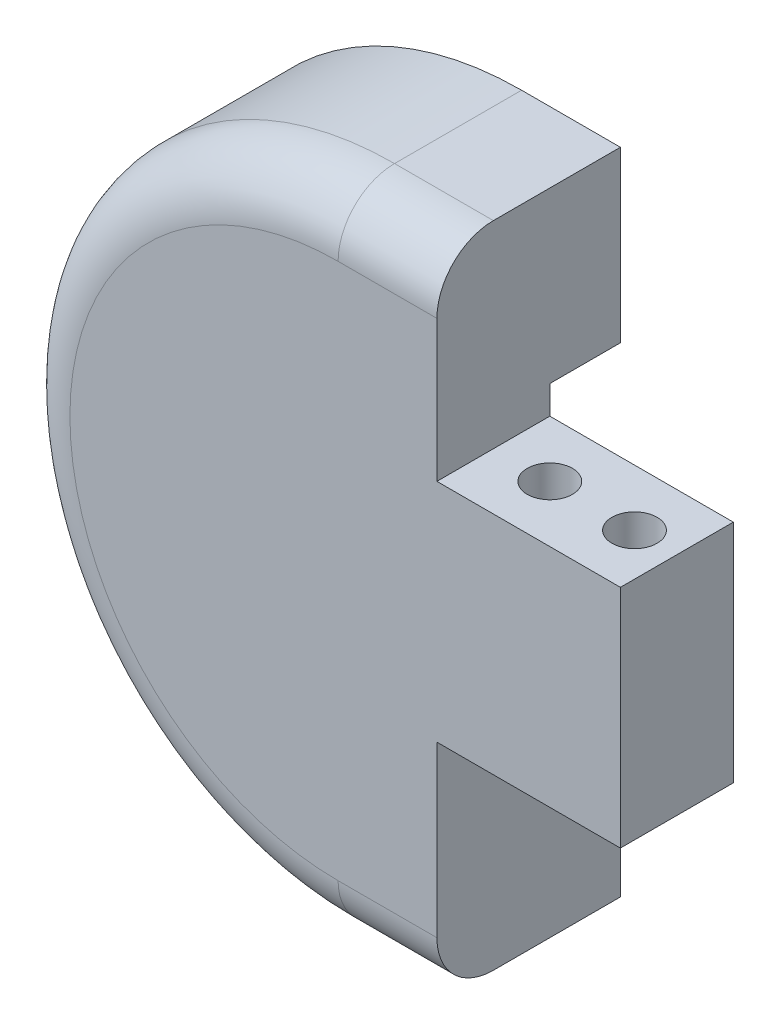
ISO-10303-21;
HEADER;
FILE_DESCRIPTION(('STEP AP214'),'2;1');
FILE_NAME('part.step','',(''),(''),'','','');
FILE_SCHEMA(('AUTOMOTIVE_DESIGN { 1 0 10303 214 1 1 1 1 }'));
ENDSEC;
DATA;
#1=APPLICATION_CONTEXT('core data for automotive mechanical design processes');
#2=APPLICATION_PROTOCOL_DEFINITION('international standard','automotive_design',2000,#1);
#3=PRODUCT_CONTEXT('',#1,'mechanical');
#4=PRODUCT('Part','Part','',(#3));
#5=PRODUCT_RELATED_PRODUCT_CATEGORY('part','',(#4));
#6=PRODUCT_DEFINITION_FORMATION('','',#4);
#7=PRODUCT_DEFINITION_CONTEXT('part definition',#1,'design');
#8=PRODUCT_DEFINITION('design','',#6,#7);
#9=PRODUCT_DEFINITION_SHAPE('','',#8);
#10=(LENGTH_UNIT() NAMED_UNIT(*) SI_UNIT(.MILLI.,.METRE.));
#11=(NAMED_UNIT(*) PLANE_ANGLE_UNIT() SI_UNIT($,.RADIAN.));
#12=(NAMED_UNIT(*) SI_UNIT($,.STERADIAN.) SOLID_ANGLE_UNIT());
#13=UNCERTAINTY_MEASURE_WITH_UNIT(LENGTH_MEASURE(1.E-05),#10,'distance_accuracy_value','');
#14=(GEOMETRIC_REPRESENTATION_CONTEXT(3) GLOBAL_UNCERTAINTY_ASSIGNED_CONTEXT((#13)) GLOBAL_UNIT_ASSIGNED_CONTEXT((#10,
#11,#12)) REPRESENTATION_CONTEXT('',''));
#15=CARTESIAN_POINT('',(0.,0.,0.));
#16=DIRECTION('',(0.,0.,1.));
#17=DIRECTION('',(1.,0.,0.));
#18=AXIS2_PLACEMENT_3D('',#15,#16,#17);
#19=CARTESIAN_POINT('',(0.,0.,2.5));
#20=DIRECTION('',(0.,0.,1.));
#21=DIRECTION('',(1.,0.,0.));
#22=AXIS2_PLACEMENT_3D('',#19,#20,#21);
#23=PLANE('',#22);
#24=DIRECTION('',(1.,0.,0.));
#25=VECTOR('',#24,1.);
#26=CARTESIAN_POINT('',(-3.99999999999979,-4.99999999999957,2.5));
#27=LINE('',#26,#25);
#28=CARTESIAN_POINT('',(-3.99999999999979,-4.99999999999957,2.5));
#29=VERTEX_POINT('',#28);
#30=CARTESIAN_POINT('',(3.5,-4.99999999999954,2.5));
#31=VERTEX_POINT('',#30);
#32=EDGE_CURVE('E396',#29,#31,#27,.T.);
#33=ORIENTED_EDGE('',*,*,#32,.F.);
#34=DIRECTION('',(0.,-1.,0.));
#35=VECTOR('',#34,1.);
#36=CARTESIAN_POINT('',(-3.99999999999982,-3.99999999999956,2.5));
#37=LINE('',#36,#35);
#38=CARTESIAN_POINT('',(-3.99999999999982,-3.99999999999956,2.5));
#39=VERTEX_POINT('',#38);
#40=EDGE_CURVE('E166',#39,#29,#37,.T.);
#41=ORIENTED_EDGE('',*,*,#40,.F.);
#42=DIRECTION('',(0.447213595499985,-0.894427190999903,0.));
#43=VECTOR('',#42,1.);
#44=CARTESIAN_POINT('',(-5.49999999999991,-0.999999999999595,2.5));
#45=LINE('',#44,#43);
#46=CARTESIAN_POINT('',(-5.49999999999991,-0.999999999999595,2.5));
#47=VERTEX_POINT('',#46);
#48=EDGE_CURVE('E160',#47,#39,#45,.T.);
#49=ORIENTED_EDGE('',*,*,#48,.F.);
#50=DIRECTION('',(0.,-1.,0.));
#51=VECTOR('',#50,1.);
#52=CARTESIAN_POINT('',(-5.49999999999993,0.500000000000406,2.5));
#53=LINE('',#52,#51);
#54=CARTESIAN_POINT('',(-5.5,2.0000000000004,2.5));
#55=VERTEX_POINT('',#54);
#56=EDGE_CURVE('E164',#55,#47,#53,.T.);
#57=ORIENTED_EDGE('',*,*,#56,.F.);
#58=DIRECTION('',(-0.44721359549993,-0.89442719099993,0.));
#59=VECTOR('',#58,1.);
#60=CARTESIAN_POINT('',(-5.5,2.0000000000004,2.5));
#61=LINE('',#60,#59);
#62=CARTESIAN_POINT('',(-4.00000000000008,5.00000000000047,2.5));
#63=VERTEX_POINT('',#62);
#64=EDGE_CURVE('E320',#63,#55,#61,.T.);
#65=ORIENTED_EDGE('',*,*,#64,.F.);
#66=DIRECTION('',(-1.11022302462496E-13,-1.,0.));
#67=VECTOR('',#66,1.);
#68=CARTESIAN_POINT('',(-4.00000000000008,5.00000000000047,2.5));
#69=LINE('',#68,#67);
#70=CARTESIAN_POINT('',(-3.99999999999997,6.00000000000065,2.5));
#71=VERTEX_POINT('',#70);
#72=EDGE_CURVE('E318',#71,#63,#69,.T.);
#73=ORIENTED_EDGE('',*,*,#72,.F.);
#74=DIRECTION('',(-1.,0.,0.));
#75=VECTOR('',#74,1.);
#76=CARTESIAN_POINT('',(0.,6.00000000000066,2.5));
#77=LINE('',#76,#75);
#78=CARTESIAN_POINT('',(3.5,6.00000000000067,2.5));
#79=VERTEX_POINT('',#78);
#80=EDGE_CURVE('E314',#79,#71,#77,.T.);
#81=ORIENTED_EDGE('',*,*,#80,.F.);
#82=DIRECTION('',(0.,1.,0.));
#83=VECTOR('',#82,1.);
#84=CARTESIAN_POINT('',(3.5,12.,2.5));
#85=LINE('',#84,#83);
#86=CARTESIAN_POINT('',(3.5,5.,2.5));
#87=VERTEX_POINT('',#86);
#88=EDGE_CURVE('E11',#87,#79,#85,.T.);
#89=ORIENTED_EDGE('',*,*,#88,.F.);
#90=DIRECTION('',(-1.,0.,0.));
#91=VECTOR('',#90,1.);
#92=CARTESIAN_POINT('',(4.25000000000448,5.00000000000051,2.5));
#93=LINE('',#92,#91);
#94=CARTESIAN_POINT('',(10.,5.00000000000051,2.5));
#95=VERTEX_POINT('',#94);
#96=EDGE_CURVE('E311',#95,#87,#93,.T.);
#97=ORIENTED_EDGE('',*,*,#96,.F.);
#98=DIRECTION('',(0.,1.,0.));
#99=VECTOR('',#98,1.);
#100=CARTESIAN_POINT('',(10.,-4.00000000000375,2.5));
#101=LINE('',#100,#99);
#102=CARTESIAN_POINT('',(10.,-3.,2.5));
#103=VERTEX_POINT('',#102);
#104=EDGE_CURVE('E315',#103,#95,#101,.T.);
#105=ORIENTED_EDGE('',*,*,#104,.F.);
#106=DIRECTION('',(1.,0.,0.));
#107=VECTOR('',#106,1.);
#108=CARTESIAN_POINT('',(10.,-3.,2.5));
#109=LINE('',#108,#107);
#110=CARTESIAN_POINT('',(3.5,-3.,2.5));
#111=VERTEX_POINT('',#110);
#112=EDGE_CURVE('E189',#111,#103,#109,.T.);
#113=ORIENTED_EDGE('',*,*,#112,.F.);
#114=DIRECTION('',(0.,1.,0.));
#115=VECTOR('',#114,1.);
#116=CARTESIAN_POINT('',(3.5,-3.,2.5));
#117=LINE('',#116,#115);
#118=EDGE_CURVE('E192',#31,#111,#117,.T.);
#119=ORIENTED_EDGE('',*,*,#118,.F.);
#120=EDGE_LOOP('',(#33,#41,#49,#57,#65,#73,#81,#89,#97,#105,#113,#119));
#121=FACE_BOUND('',#120,.T.);
#122=CARTESIAN_POINT('',(0.,0.,2.5));
#123=DIRECTION('',(0.,0.,1.));
#124=DIRECTION('',(1.,0.,0.));
#125=AXIS2_PLACEMENT_3D('',#122,#123,#124);
#126=CIRCLE('',#125,2.75);
#127=CARTESIAN_POINT('',(2.75,0.,2.5));
#128=VERTEX_POINT('',#127);
#129=EDGE_CURVE('E391',#128,#128,#126,.T.);
#130=ORIENTED_EDGE('',*,*,#129,.T.);
#131=EDGE_LOOP('',(#130));
#132=FACE_BOUND('',#131,.T.);
#133=ADVANCED_FACE('F33',(#121,#132),#23,.F.);
#134=CARTESIAN_POINT('',(3.5,-3.,6.5));
#135=DIRECTION('',(-1.,0.,0.));
#136=DIRECTION('',(0.,0.,1.));
#137=AXIS2_PLACEMENT_3D('',#134,#135,#136);
#138=PLANE('',#137);
#139=DIRECTION('',(0.,0.,-1.));
#140=VECTOR('',#139,1.);
#141=CARTESIAN_POINT('',(3.5,-4.99999999999955,6.5));
#142=LINE('',#141,#140);
#143=CARTESIAN_POINT('',(3.5,-4.99999999999955,0.));
#144=VERTEX_POINT('',#143);
#145=EDGE_CURVE('E182',#31,#144,#142,.T.);
#146=ORIENTED_EDGE('',*,*,#145,.F.);
#147=ORIENTED_EDGE('',*,*,#118,.T.);
#148=DIRECTION('',(0.,0.,-1.));
#149=VECTOR('',#148,1.);
#150=CARTESIAN_POINT('',(3.5,-3.,6.5));
#151=LINE('',#150,#149);
#152=CARTESIAN_POINT('',(3.5,-3.,6.5));
#153=VERTEX_POINT('',#152);
#154=EDGE_CURVE('E243',#153,#111,#151,.T.);
#155=ORIENTED_EDGE('',*,*,#154,.F.);
#156=DIRECTION('',(0.,1.,0.));
#157=VECTOR('',#156,1.);
#158=CARTESIAN_POINT('',(3.5,-3.,6.5));
#159=LINE('',#158,#157);
#160=CARTESIAN_POINT('',(3.5,-9.,6.5));
#161=VERTEX_POINT('',#160);
#162=EDGE_CURVE('E205',#161,#153,#159,.T.);
#163=ORIENTED_EDGE('',*,*,#162,.F.);
#164=CARTESIAN_POINT('',(3.5,-9.,4.5));
#165=DIRECTION('',(-1.,0.,0.));
#166=DIRECTION('',(0.,0.,1.));
#167=AXIS2_PLACEMENT_3D('',#164,#165,#166);
#168=CIRCLE('',#167,2.);
#169=CARTESIAN_POINT('',(3.5,-11.,4.5));
#170=VERTEX_POINT('',#169);
#171=EDGE_CURVE('E266',#161,#170,#168,.F.);
#172=ORIENTED_EDGE('',*,*,#171,.T.);
#173=DIRECTION('',(0.,0.,-1.));
#174=VECTOR('',#173,1.);
#175=CARTESIAN_POINT('',(3.5,-11.,6.5));
#176=LINE('',#175,#174);
#177=CARTESIAN_POINT('',(3.5,-11.,0.));
#178=VERTEX_POINT('',#177);
#179=EDGE_CURVE('E246',#170,#178,#176,.T.);
#180=ORIENTED_EDGE('',*,*,#179,.T.);
#181=DIRECTION('',(0.,1.,0.));
#182=VECTOR('',#181,1.);
#183=CARTESIAN_POINT('',(3.5,-3.,0.));
#184=LINE('',#183,#182);
#185=EDGE_CURVE('E223',#178,#144,#184,.T.);
#186=ORIENTED_EDGE('',*,*,#185,.T.);
#187=EDGE_LOOP('',(#146,#147,#155,#163,#172,#180,#186));
#188=FACE_BOUND('',#187,.T.);
#189=ADVANCED_FACE('F365',(#188),#138,.F.);
#190=CARTESIAN_POINT('',(3.5,12.,6.5));
#191=DIRECTION('',(-1.,0.,0.));
#192=DIRECTION('',(0.,0.,1.));
#193=AXIS2_PLACEMENT_3D('',#190,#191,#192);
#194=PLANE('',#193);
#195=DIRECTION('',(0.,0.,1.));
#196=VECTOR('',#195,1.);
#197=CARTESIAN_POINT('',(3.5,6.00000000000067,6.5));
#198=LINE('',#197,#196);
#199=CARTESIAN_POINT('',(3.5,6.00000000000067,0.));
#200=VERTEX_POINT('',#199);
#201=EDGE_CURVE('E179',#200,#79,#198,.T.);
#202=ORIENTED_EDGE('',*,*,#201,.F.);
#203=DIRECTION('',(0.,1.,0.));
#204=VECTOR('',#203,1.);
#205=CARTESIAN_POINT('',(3.5,12.,0.));
#206=LINE('',#205,#204);
#207=CARTESIAN_POINT('',(3.5,12.,0.));
#208=VERTEX_POINT('',#207);
#209=EDGE_CURVE('E226',#200,#208,#206,.T.);
#210=ORIENTED_EDGE('',*,*,#209,.T.);
#211=DIRECTION('',(0.,0.,-1.));
#212=VECTOR('',#211,1.);
#213=CARTESIAN_POINT('',(3.5,12.,6.5));
#214=LINE('',#213,#212);
#215=CARTESIAN_POINT('',(3.5,12.,4.5));
#216=VERTEX_POINT('',#215);
#217=EDGE_CURVE('E231',#216,#208,#214,.T.);
#218=ORIENTED_EDGE('',*,*,#217,.F.);
#219=CARTESIAN_POINT('',(3.5,10.,4.5));
#220=DIRECTION('',(-1.,0.,0.));
#221=DIRECTION('',(0.,0.,1.));
#222=AXIS2_PLACEMENT_3D('',#219,#220,#221);
#223=CIRCLE('',#222,2.);
#224=CARTESIAN_POINT('',(3.5,10.,6.5));
#225=VERTEX_POINT('',#224);
#226=EDGE_CURVE('E264',#216,#225,#223,.F.);
#227=ORIENTED_EDGE('',*,*,#226,.T.);
#228=DIRECTION('',(0.,1.,0.));
#229=VECTOR('',#228,1.);
#230=CARTESIAN_POINT('',(3.5,12.,6.5));
#231=LINE('',#230,#229);
#232=CARTESIAN_POINT('',(3.5,5.,6.5));
#233=VERTEX_POINT('',#232);
#234=EDGE_CURVE('E214',#233,#225,#231,.T.);
#235=ORIENTED_EDGE('',*,*,#234,.F.);
#236=DIRECTION('',(0.,0.,-1.));
#237=VECTOR('',#236,1.);
#238=CARTESIAN_POINT('',(3.5,5.,6.5));
#239=LINE('',#238,#237);
#240=EDGE_CURVE('E234',#233,#87,#239,.T.);
#241=ORIENTED_EDGE('',*,*,#240,.T.);
#242=ORIENTED_EDGE('',*,*,#88,.T.);
#243=EDGE_LOOP('',(#202,#210,#218,#227,#235,#241,#242));
#244=FACE_BOUND('',#243,.T.);
#245=ADVANCED_FACE('F285',(#244),#194,.F.);
#246=CARTESIAN_POINT('',(0.,0.5,0.));
#247=DIRECTION('',(0.,0.,1.));
#248=DIRECTION('',(1.,0.,0.));
#249=AXIS2_PLACEMENT_3D('',#246,#247,#248);
#250=PLANE('',#249);
#251=DIRECTION('',(1.,0.,0.));
#252=VECTOR('',#251,1.);
#253=CARTESIAN_POINT('',(0.,-4.99999999999956,0.));
#254=LINE('',#253,#252);
#255=CARTESIAN_POINT('',(-3.99999999999979,-4.99999999999957,0.));
#256=VERTEX_POINT('',#255);
#257=EDGE_CURVE('E330',#256,#144,#254,.T.);
#258=ORIENTED_EDGE('',*,*,#257,.T.);
#259=ORIENTED_EDGE('',*,*,#185,.F.);
#260=DIRECTION('',(1.,0.,0.));
#261=VECTOR('',#260,1.);
#262=CARTESIAN_POINT('',(0.,-11.,0.));
#263=LINE('',#262,#261);
#264=CARTESIAN_POINT('',(0.,-11.,0.));
#265=VERTEX_POINT('',#264);
#266=EDGE_CURVE('E220',#265,#178,#263,.T.);
#267=ORIENTED_EDGE('',*,*,#266,.F.);
#268=CARTESIAN_POINT('',(0.,0.5,0.));
#269=DIRECTION('',(0.,0.,1.));
#270=DIRECTION('',(1.,0.,0.));
#271=AXIS2_PLACEMENT_3D('',#268,#269,#270);
#272=CIRCLE('',#271,11.5);
#273=CARTESIAN_POINT('',(0.,12.,0.));
#274=VERTEX_POINT('',#273);
#275=EDGE_CURVE('E204',#274,#265,#272,.T.);
#276=ORIENTED_EDGE('',*,*,#275,.F.);
#277=DIRECTION('',(-1.,0.,0.));
#278=VECTOR('',#277,1.);
#279=CARTESIAN_POINT('',(0.,12.,0.));
#280=LINE('',#279,#278);
#281=EDGE_CURVE('E208',#208,#274,#280,.T.);
#282=ORIENTED_EDGE('',*,*,#281,.F.);
#283=ORIENTED_EDGE('',*,*,#209,.F.);
#284=DIRECTION('',(1.,0.,0.));
#285=VECTOR('',#284,1.);
#286=CARTESIAN_POINT('',(0.,6.00000000000066,0.));
#287=LINE('',#286,#285);
#288=CARTESIAN_POINT('',(-3.99999999999997,6.00000000000065,0.));
#289=VERTEX_POINT('',#288);
#290=EDGE_CURVE('E41',#289,#200,#287,.T.);
#291=ORIENTED_EDGE('',*,*,#290,.F.);
#292=DIRECTION('',(-1.11022302462496E-13,-1.,0.));
#293=VECTOR('',#292,1.);
#294=CARTESIAN_POINT('',(-4.00000000000008,5.00000000000047,0.));
#295=LINE('',#294,#293);
#296=CARTESIAN_POINT('',(-4.00000000000008,5.00000000000047,0.));
#297=VERTEX_POINT('',#296);
#298=EDGE_CURVE('E332',#289,#297,#295,.T.);
#299=ORIENTED_EDGE('',*,*,#298,.T.);
#300=DIRECTION('',(-0.44721359549993,-0.89442719099993,0.));
#301=VECTOR('',#300,1.);
#302=CARTESIAN_POINT('',(-5.5,2.0000000000004,0.));
#303=LINE('',#302,#301);
#304=CARTESIAN_POINT('',(-5.5,2.0000000000004,0.));
#305=VERTEX_POINT('',#304);
#306=EDGE_CURVE('E334',#297,#305,#303,.T.);
#307=ORIENTED_EDGE('',*,*,#306,.T.);
#308=DIRECTION('',(0.,-1.,0.));
#309=VECTOR('',#308,1.);
#310=CARTESIAN_POINT('',(-5.5,2.0000000000004,0.));
#311=LINE('',#310,#309);
#312=CARTESIAN_POINT('',(-5.49999999999986,-0.999999999999595,0.));
#313=VERTEX_POINT('',#312);
#314=EDGE_CURVE('E173',#305,#313,#311,.T.);
#315=ORIENTED_EDGE('',*,*,#314,.T.);
#316=DIRECTION('',(0.447213595499985,-0.894427190999903,0.));
#317=VECTOR('',#316,1.);
#318=CARTESIAN_POINT('',(-5.49999999999991,-0.999999999999595,0.));
#319=LINE('',#318,#317);
#320=CARTESIAN_POINT('',(-3.99999999999982,-3.99999999999956,0.));
#321=VERTEX_POINT('',#320);
#322=EDGE_CURVE('E177',#313,#321,#319,.T.);
#323=ORIENTED_EDGE('',*,*,#322,.T.);
#324=DIRECTION('',(0.,-1.,0.));
#325=VECTOR('',#324,1.);
#326=CARTESIAN_POINT('',(-3.99999999999982,-3.99999999999956,0.));
#327=LINE('',#326,#325);
#328=EDGE_CURVE('E326',#321,#256,#327,.T.);
#329=ORIENTED_EDGE('',*,*,#328,.T.);
#330=EDGE_LOOP('',(#258,#259,#267,#276,#282,#283,#291,#299,#307,#315,#323,#329));
#331=FACE_BOUND('',#330,.T.);
#332=ADVANCED_FACE('F290',(#331),#250,.F.);
#333=CARTESIAN_POINT('',(0.,0.5,6.5));
#334=DIRECTION('',(0.,0.,-1.));
#335=DIRECTION('',(-1.,0.,0.));
#336=AXIS2_PLACEMENT_3D('',#333,#334,#335);
#337=CYLINDRICAL_SURFACE('',#336,11.5);
#338=DIRECTION('',(0.,0.,-1.));
#339=VECTOR('',#338,1.);
#340=CARTESIAN_POINT('',(0.,-11.,6.5));
#341=LINE('',#340,#339);
#342=CARTESIAN_POINT('',(0.,-11.,4.5));
#343=VERTEX_POINT('',#342);
#344=EDGE_CURVE('E248',#343,#265,#341,.T.);
#345=ORIENTED_EDGE('',*,*,#344,.F.);
#346=CARTESIAN_POINT('',(0.,0.5,4.5));
#347=DIRECTION('',(0.,0.,1.));
#348=DIRECTION('',(1.,0.,0.));
#349=AXIS2_PLACEMENT_3D('',#346,#347,#348);
#350=CIRCLE('',#349,11.5);
#351=CARTESIAN_POINT('',(0.,12.,4.5));
#352=VERTEX_POINT('',#351);
#353=EDGE_CURVE('E269',#343,#352,#350,.F.);
#354=ORIENTED_EDGE('',*,*,#353,.T.);
#355=DIRECTION('',(0.,0.,-1.));
#356=VECTOR('',#355,1.);
#357=CARTESIAN_POINT('',(0.,12.,6.5));
#358=LINE('',#357,#356);
#359=EDGE_CURVE('E217',#352,#274,#358,.T.);
#360=ORIENTED_EDGE('',*,*,#359,.T.);
#361=ORIENTED_EDGE('',*,*,#275,.T.);
#362=EDGE_LOOP('',(#345,#354,#360,#361));
#363=FACE_BOUND('',#362,.T.);
#364=ADVANCED_FACE('F432',(#363),#337,.T.);
#365=CARTESIAN_POINT('',(0.,-11.,6.5));
#366=DIRECTION('',(0.,1.,0.));
#367=DIRECTION('',(0.,0.,1.));
#368=AXIS2_PLACEMENT_3D('',#365,#366,#367);
#369=PLANE('',#368);
#370=ORIENTED_EDGE('',*,*,#179,.F.);
#371=DIRECTION('',(1.,0.,0.));
#372=VECTOR('',#371,1.);
#373=CARTESIAN_POINT('',(0.,-11.,4.5));
#374=LINE('',#373,#372);
#375=EDGE_CURVE('E56',#170,#343,#374,.F.);
#376=ORIENTED_EDGE('',*,*,#375,.T.);
#377=ORIENTED_EDGE('',*,*,#344,.T.);
#378=ORIENTED_EDGE('',*,*,#266,.T.);
#379=EDGE_LOOP('',(#370,#376,#377,#378));
#380=FACE_BOUND('',#379,.T.);
#381=ADVANCED_FACE('F443',(#380),#369,.F.);
#382=CARTESIAN_POINT('',(10.,-3.,6.5));
#383=DIRECTION('',(0.,1.,0.));
#384=DIRECTION('',(0.,0.,1.));
#385=AXIS2_PLACEMENT_3D('',#382,#383,#384);
#386=PLANE('',#385);
#387=CARTESIAN_POINT('',(5.5,-3.,4.5));
#388=DIRECTION('',(0.,1.,0.));
#389=DIRECTION('',(0.,0.,1.));
#390=AXIS2_PLACEMENT_3D('',#387,#388,#389);
#391=CIRCLE('',#390,0.8);
#392=CARTESIAN_POINT('',(5.5,-3.,5.3));
#393=VERTEX_POINT('',#392);
#394=EDGE_CURVE('E196',#393,#393,#391,.T.);
#395=ORIENTED_EDGE('',*,*,#394,.T.);
#396=EDGE_LOOP('',(#395));
#397=FACE_BOUND('',#396,.T.);
#398=CARTESIAN_POINT('',(8.5,-3.,4.5));
#399=DIRECTION('',(0.,1.,0.));
#400=DIRECTION('',(0.,0.,1.));
#401=AXIS2_PLACEMENT_3D('',#398,#399,#400);
#402=CIRCLE('',#401,0.799999999999999);
#403=CARTESIAN_POINT('',(8.5,-3.,5.3));
#404=VERTEX_POINT('',#403);
#405=EDGE_CURVE('E201',#404,#404,#402,.T.);
#406=ORIENTED_EDGE('',*,*,#405,.T.);
#407=EDGE_LOOP('',(#406));
#408=FACE_BOUND('',#407,.T.);
#409=ORIENTED_EDGE('',*,*,#154,.T.);
#410=ORIENTED_EDGE('',*,*,#112,.T.);
#411=DIRECTION('',(0.,0.,-1.));
#412=VECTOR('',#411,1.);
#413=CARTESIAN_POINT('',(10.,-3.,6.5));
#414=LINE('',#413,#412);
#415=CARTESIAN_POINT('',(10.,-3.,6.5));
#416=VERTEX_POINT('',#415);
#417=EDGE_CURVE('E240',#416,#103,#414,.T.);
#418=ORIENTED_EDGE('',*,*,#417,.F.);
#419=DIRECTION('',(1.,0.,0.));
#420=VECTOR('',#419,1.);
#421=CARTESIAN_POINT('',(10.,-3.,6.5));
#422=LINE('',#421,#420);
#423=EDGE_CURVE('E207',#153,#416,#422,.T.);
#424=ORIENTED_EDGE('',*,*,#423,.F.);
#425=EDGE_LOOP('',(#409,#410,#418,#424));
#426=FACE_BOUND('',#425,.T.);
#427=ADVANCED_FACE('F402',(#397,#408,#426),#386,.F.);
#428=CARTESIAN_POINT('',(10.,5.,6.5));
#429=DIRECTION('',(-1.,0.,0.));
#430=DIRECTION('',(0.,0.,1.));
#431=AXIS2_PLACEMENT_3D('',#428,#429,#430);
#432=PLANE('',#431);
#433=ORIENTED_EDGE('',*,*,#417,.T.);
#434=ORIENTED_EDGE('',*,*,#104,.T.);
#435=DIRECTION('',(0.,0.,-1.));
#436=VECTOR('',#435,1.);
#437=CARTESIAN_POINT('',(10.,5.,6.5));
#438=LINE('',#437,#436);
#439=CARTESIAN_POINT('',(10.,5.,6.5));
#440=VERTEX_POINT('',#439);
#441=EDGE_CURVE('E237',#440,#95,#438,.T.);
#442=ORIENTED_EDGE('',*,*,#441,.F.);
#443=DIRECTION('',(0.,1.,0.));
#444=VECTOR('',#443,1.);
#445=CARTESIAN_POINT('',(10.,5.,6.5));
#446=LINE('',#445,#444);
#447=EDGE_CURVE('E210',#416,#440,#446,.T.);
#448=ORIENTED_EDGE('',*,*,#447,.F.);
#449=EDGE_LOOP('',(#433,#434,#442,#448));
#450=FACE_BOUND('',#449,.T.);
#451=ADVANCED_FACE('F398',(#450),#432,.F.);
#452=CARTESIAN_POINT('',(3.5,5.,6.5));
#453=DIRECTION('',(0.,-1.,0.));
#454=DIRECTION('',(0.,0.,-1.));
#455=AXIS2_PLACEMENT_3D('',#452,#453,#454);
#456=PLANE('',#455);
#457=CARTESIAN_POINT('',(5.5,5.,4.5));
#458=DIRECTION('',(0.,-1.,0.));
#459=DIRECTION('',(0.,0.,-1.));
#460=AXIS2_PLACEMENT_3D('',#457,#458,#459);
#461=CIRCLE('',#460,0.8);
#462=CARTESIAN_POINT('',(5.5,5.,3.7));
#463=VERTEX_POINT('',#462);
#464=EDGE_CURVE('E200',#463,#463,#461,.T.);
#465=ORIENTED_EDGE('',*,*,#464,.T.);
#466=EDGE_LOOP('',(#465));
#467=FACE_BOUND('',#466,.T.);
#468=CARTESIAN_POINT('',(8.5,5.,4.5));
#469=DIRECTION('',(0.,-1.,0.));
#470=DIRECTION('',(0.,0.,-1.));
#471=AXIS2_PLACEMENT_3D('',#468,#469,#470);
#472=CIRCLE('',#471,0.799999999999999);
#473=CARTESIAN_POINT('',(8.5,5.,3.7));
#474=VERTEX_POINT('',#473);
#475=EDGE_CURVE('E199',#474,#474,#472,.T.);
#476=ORIENTED_EDGE('',*,*,#475,.T.);
#477=EDGE_LOOP('',(#476));
#478=FACE_BOUND('',#477,.T.);
#479=ORIENTED_EDGE('',*,*,#441,.T.);
#480=ORIENTED_EDGE('',*,*,#96,.T.);
#481=ORIENTED_EDGE('',*,*,#240,.F.);
#482=DIRECTION('',(-1.,0.,0.));
#483=VECTOR('',#482,1.);
#484=CARTESIAN_POINT('',(3.5,5.,6.5));
#485=LINE('',#484,#483);
#486=EDGE_CURVE('E212',#440,#233,#485,.T.);
#487=ORIENTED_EDGE('',*,*,#486,.F.);
#488=EDGE_LOOP('',(#479,#480,#481,#487));
#489=FACE_BOUND('',#488,.T.);
#490=ADVANCED_FACE('F310',(#467,#478,#489),#456,.F.);
#491=CARTESIAN_POINT('',(0.,12.,6.5));
#492=DIRECTION('',(0.,-1.,0.));
#493=DIRECTION('',(0.,0.,-1.));
#494=AXIS2_PLACEMENT_3D('',#491,#492,#493);
#495=PLANE('',#494);
#496=ORIENTED_EDGE('',*,*,#359,.F.);
#497=DIRECTION('',(-1.,0.,0.));
#498=VECTOR('',#497,1.);
#499=CARTESIAN_POINT('',(3.5,12.,4.5));
#500=LINE('',#499,#498);
#501=EDGE_CURVE('E262',#352,#216,#500,.F.);
#502=ORIENTED_EDGE('',*,*,#501,.T.);
#503=ORIENTED_EDGE('',*,*,#217,.T.);
#504=ORIENTED_EDGE('',*,*,#281,.T.);
#505=EDGE_LOOP('',(#496,#502,#503,#504));
#506=FACE_BOUND('',#505,.T.);
#507=ADVANCED_FACE('F295',(#506),#495,.F.);
#508=CARTESIAN_POINT('',(0.,0.5,6.5));
#509=DIRECTION('',(0.,0.,1.));
#510=DIRECTION('',(1.,0.,0.));
#511=AXIS2_PLACEMENT_3D('',#508,#509,#510);
#512=PLANE('',#511);
#513=ORIENTED_EDGE('',*,*,#234,.T.);
#514=DIRECTION('',(-1.,0.,0.));
#515=VECTOR('',#514,1.);
#516=CARTESIAN_POINT('',(0.,10.,6.5));
#517=LINE('',#516,#515);
#518=CARTESIAN_POINT('',(0.,10.,6.5));
#519=VERTEX_POINT('',#518);
#520=EDGE_CURVE('E259',#225,#519,#517,.T.);
#521=ORIENTED_EDGE('',*,*,#520,.T.);
#522=CARTESIAN_POINT('',(0.,0.5,6.5));
#523=DIRECTION('',(0.,0.,1.));
#524=DIRECTION('',(1.,0.,0.));
#525=AXIS2_PLACEMENT_3D('',#522,#523,#524);
#526=CIRCLE('',#525,9.5);
#527=CARTESIAN_POINT('',(0.,-9.,6.5));
#528=VERTEX_POINT('',#527);
#529=EDGE_CURVE('E250',#519,#528,#526,.T.);
#530=ORIENTED_EDGE('',*,*,#529,.T.);
#531=DIRECTION('',(1.,0.,0.));
#532=VECTOR('',#531,1.);
#533=CARTESIAN_POINT('',(3.5,-9.,6.5));
#534=LINE('',#533,#532);
#535=EDGE_CURVE('E257',#528,#161,#534,.T.);
#536=ORIENTED_EDGE('',*,*,#535,.T.);
#537=ORIENTED_EDGE('',*,*,#162,.T.);
#538=ORIENTED_EDGE('',*,*,#423,.T.);
#539=ORIENTED_EDGE('',*,*,#447,.T.);
#540=ORIENTED_EDGE('',*,*,#486,.T.);
#541=EDGE_LOOP('',(#513,#521,#530,#536,#537,#538,#539,#540));
#542=FACE_BOUND('',#541,.T.);
#543=ADVANCED_FACE('F305',(#542),#512,.T.);
#544=CARTESIAN_POINT('',(8.5,-11.,4.5));
#545=DIRECTION('',(0.,1.,0.));
#546=DIRECTION('',(0.,0.,1.));
#547=AXIS2_PLACEMENT_3D('',#544,#545,#546);
#548=CYLINDRICAL_SURFACE('',#547,0.799999999999999);
#549=ORIENTED_EDGE('',*,*,#475,.F.);
#550=EDGE_LOOP('',(#549));
#551=FACE_BOUND('',#550,.T.);
#552=ORIENTED_EDGE('',*,*,#405,.F.);
#553=EDGE_LOOP('',(#552));
#554=FACE_BOUND('',#553,.T.);
#555=ADVANCED_FACE('F423',(#551,#554),#548,.F.);
#556=CARTESIAN_POINT('',(5.5,-11.,4.5));
#557=DIRECTION('',(0.,1.,0.));
#558=DIRECTION('',(0.,0.,1.));
#559=AXIS2_PLACEMENT_3D('',#556,#557,#558);
#560=CYLINDRICAL_SURFACE('',#559,0.8);
#561=ORIENTED_EDGE('',*,*,#464,.F.);
#562=EDGE_LOOP('',(#561));
#563=FACE_BOUND('',#562,.T.);
#564=ORIENTED_EDGE('',*,*,#394,.F.);
#565=EDGE_LOOP('',(#564));
#566=FACE_BOUND('',#565,.T.);
#567=ADVANCED_FACE('F420',(#563,#566),#560,.F.);
#568=CARTESIAN_POINT('',(0.,-9.,4.5));
#569=DIRECTION('',(-1.,0.,0.));
#570=DIRECTION('',(0.,0.,1.));
#571=AXIS2_PLACEMENT_3D('',#568,#569,#570);
#572=CYLINDRICAL_SURFACE('',#571,2.);
#573=ORIENTED_EDGE('',*,*,#171,.F.);
#574=ORIENTED_EDGE('',*,*,#535,.F.);
#575=CARTESIAN_POINT('',(0.,-9.,4.5));
#576=DIRECTION('',(-1.,0.,0.));
#577=DIRECTION('',(0.,0.,1.));
#578=AXIS2_PLACEMENT_3D('',#575,#576,#577);
#579=CIRCLE('',#578,2.);
#580=EDGE_CURVE('E255',#343,#528,#579,.T.);
#581=ORIENTED_EDGE('',*,*,#580,.F.);
#582=ORIENTED_EDGE('',*,*,#375,.F.);
#583=EDGE_LOOP('',(#573,#574,#581,#582));
#584=FACE_BOUND('',#583,.T.);
#585=ADVANCED_FACE('F35',(#584),#572,.T.);
#586=CARTESIAN_POINT('',(0.,0.5,4.5));
#587=DIRECTION('',(0.,0.,1.));
#588=DIRECTION('',(1.,0.,0.));
#589=AXIS2_PLACEMENT_3D('',#586,#587,#588);
#590=TOROIDAL_SURFACE('',#589,9.5,2.);
#591=ORIENTED_EDGE('',*,*,#580,.T.);
#592=ORIENTED_EDGE('',*,*,#529,.F.);
#593=CARTESIAN_POINT('',(0.,10.,4.5));
#594=DIRECTION('',(1.,0.,0.));
#595=DIRECTION('',(0.,0.,-1.));
#596=AXIS2_PLACEMENT_3D('',#593,#594,#595);
#597=CIRCLE('',#596,2.);
#598=EDGE_CURVE('E195',#352,#519,#597,.T.);
#599=ORIENTED_EDGE('',*,*,#598,.F.);
#600=ORIENTED_EDGE('',*,*,#353,.F.);
#601=EDGE_LOOP('',(#591,#592,#599,#600));
#602=FACE_BOUND('',#601,.T.);
#603=ADVANCED_FACE('F415',(#602),#590,.T.);
#604=CARTESIAN_POINT('',(0.,10.,4.5));
#605=DIRECTION('',(1.,0.,0.));
#606=DIRECTION('',(0.,0.,-1.));
#607=AXIS2_PLACEMENT_3D('',#604,#605,#606);
#608=CYLINDRICAL_SURFACE('',#607,2.);
#609=ORIENTED_EDGE('',*,*,#226,.F.);
#610=ORIENTED_EDGE('',*,*,#501,.F.);
#611=ORIENTED_EDGE('',*,*,#598,.T.);
#612=ORIENTED_EDGE('',*,*,#520,.F.);
#613=EDGE_LOOP('',(#609,#610,#611,#612));
#614=FACE_BOUND('',#613,.T.);
#615=ADVANCED_FACE('F301',(#614),#608,.T.);
#616=CARTESIAN_POINT('',(0.,-4.99999999999956,2.5));
#617=DIRECTION('',(0.,1.,0.));
#618=DIRECTION('',(-1.,0.,0.));
#619=AXIS2_PLACEMENT_3D('',#616,#617,#618);
#620=PLANE('',#619);
#621=ORIENTED_EDGE('',*,*,#145,.T.);
#622=ORIENTED_EDGE('',*,*,#257,.F.);
#623=DIRECTION('',(0.,0.,-1.));
#624=VECTOR('',#623,1.);
#625=CARTESIAN_POINT('',(-3.99999999999979,-4.99999999999957,2.5));
#626=LINE('',#625,#624);
#627=EDGE_CURVE('E184',#29,#256,#626,.T.);
#628=ORIENTED_EDGE('',*,*,#627,.F.);
#629=ORIENTED_EDGE('',*,*,#32,.T.);
#630=EDGE_LOOP('',(#621,#622,#628,#629));
#631=FACE_BOUND('',#630,.T.);
#632=ADVANCED_FACE('F408',(#631),#620,.T.);
#633=CARTESIAN_POINT('',(-3.99999999999997,6.00000000000065,2.5));
#634=DIRECTION('',(0.,-1.,0.));
#635=DIRECTION('',(1.,0.,0.));
#636=AXIS2_PLACEMENT_3D('',#633,#634,#635);
#637=PLANE('',#636);
#638=ORIENTED_EDGE('',*,*,#201,.T.);
#639=ORIENTED_EDGE('',*,*,#80,.T.);
#640=DIRECTION('',(0.,0.,-1.));
#641=VECTOR('',#640,1.);
#642=CARTESIAN_POINT('',(-3.99999999999997,6.00000000000065,2.5));
#643=LINE('',#642,#641);
#644=EDGE_CURVE('E279',#71,#289,#643,.T.);
#645=ORIENTED_EDGE('',*,*,#644,.T.);
#646=ORIENTED_EDGE('',*,*,#290,.T.);
#647=EDGE_LOOP('',(#638,#639,#645,#646));
#648=FACE_BOUND('',#647,.T.);
#649=ADVANCED_FACE('F276',(#648),#637,.T.);
#650=CARTESIAN_POINT('',(-5.49999999999991,-0.999999999999595,2.5));
#651=DIRECTION('',(0.894427190999903,0.447213595499985,0.));
#652=DIRECTION('',(-0.447213595499985,0.894427190999903,0.));
#653=AXIS2_PLACEMENT_3D('',#650,#651,#652);
#654=PLANE('',#653);
#655=ORIENTED_EDGE('',*,*,#322,.F.);
#656=DIRECTION('',(0.,0.,-1.));
#657=VECTOR('',#656,1.);
#658=CARTESIAN_POINT('',(-5.49999999999991,-0.999999999999595,2.5));
#659=LINE('',#658,#657);
#660=EDGE_CURVE('E48',#47,#313,#659,.T.);
#661=ORIENTED_EDGE('',*,*,#660,.F.);
#662=ORIENTED_EDGE('',*,*,#48,.T.);
#663=DIRECTION('',(0.,0.,-1.));
#664=VECTOR('',#663,1.);
#665=CARTESIAN_POINT('',(-3.99999999999982,-3.99999999999956,2.5));
#666=LINE('',#665,#664);
#667=EDGE_CURVE('E180',#39,#321,#666,.T.);
#668=ORIENTED_EDGE('',*,*,#667,.T.);
#669=EDGE_LOOP('',(#655,#661,#662,#668));
#670=FACE_BOUND('',#669,.T.);
#671=ADVANCED_FACE('F175',(#670),#654,.T.);
#672=CARTESIAN_POINT('',(-3.99999999999982,-3.99999999999956,2.5));
#673=DIRECTION('',(1.,0.,0.));
#674=DIRECTION('',(0.,1.,0.));
#675=AXIS2_PLACEMENT_3D('',#672,#673,#674);
#676=PLANE('',#675);
#677=ORIENTED_EDGE('',*,*,#328,.F.);
#678=ORIENTED_EDGE('',*,*,#667,.F.);
#679=ORIENTED_EDGE('',*,*,#40,.T.);
#680=ORIENTED_EDGE('',*,*,#627,.T.);
#681=EDGE_LOOP('',(#677,#678,#679,#680));
#682=FACE_BOUND('',#681,.T.);
#683=ADVANCED_FACE('F345',(#682),#676,.T.);
#684=CARTESIAN_POINT('',(-4.00000000000008,5.00000000000047,2.5));
#685=DIRECTION('',(1.,-1.11022302462496E-13,0.));
#686=DIRECTION('',(1.11022302462496E-13,1.,0.));
#687=AXIS2_PLACEMENT_3D('',#684,#685,#686);
#688=PLANE('',#687);
#689=ORIENTED_EDGE('',*,*,#298,.F.);
#690=ORIENTED_EDGE('',*,*,#644,.F.);
#691=ORIENTED_EDGE('',*,*,#72,.T.);
#692=DIRECTION('',(0.,0.,-1.));
#693=VECTOR('',#692,1.);
#694=CARTESIAN_POINT('',(-4.00000000000008,5.00000000000047,2.5));
#695=LINE('',#694,#693);
#696=EDGE_CURVE('E339',#63,#297,#695,.T.);
#697=ORIENTED_EDGE('',*,*,#696,.T.);
#698=EDGE_LOOP('',(#689,#690,#691,#697));
#699=FACE_BOUND('',#698,.T.);
#700=ADVANCED_FACE('F354',(#699),#688,.T.);
#701=CARTESIAN_POINT('',(-5.5,2.0000000000004,2.5));
#702=DIRECTION('',(0.89442719099993,-0.44721359549993,0.));
#703=DIRECTION('',(0.44721359549993,0.89442719099993,0.));
#704=AXIS2_PLACEMENT_3D('',#701,#702,#703);
#705=PLANE('',#704);
#706=ORIENTED_EDGE('',*,*,#306,.F.);
#707=ORIENTED_EDGE('',*,*,#696,.F.);
#708=ORIENTED_EDGE('',*,*,#64,.T.);
#709=DIRECTION('',(0.,0.,-1.));
#710=VECTOR('',#709,1.);
#711=CARTESIAN_POINT('',(-5.5,2.0000000000004,2.5));
#712=LINE('',#711,#710);
#713=EDGE_CURVE('E172',#55,#305,#712,.T.);
#714=ORIENTED_EDGE('',*,*,#713,.T.);
#715=EDGE_LOOP('',(#706,#707,#708,#714));
#716=FACE_BOUND('',#715,.T.);
#717=ADVANCED_FACE('F352',(#716),#705,.T.);
#718=CARTESIAN_POINT('',(-5.5,2.0000000000004,2.5));
#719=DIRECTION('',(1.,0.,0.));
#720=DIRECTION('',(0.,1.,0.));
#721=AXIS2_PLACEMENT_3D('',#718,#719,#720);
#722=PLANE('',#721);
#723=ORIENTED_EDGE('',*,*,#314,.F.);
#724=ORIENTED_EDGE('',*,*,#713,.F.);
#725=ORIENTED_EDGE('',*,*,#56,.T.);
#726=ORIENTED_EDGE('',*,*,#660,.T.);
#727=EDGE_LOOP('',(#723,#724,#725,#726));
#728=FACE_BOUND('',#727,.T.);
#729=ADVANCED_FACE('F171',(#728),#722,.T.);
#730=CARTESIAN_POINT('',(0.,0.,4.));
#731=DIRECTION('',(0.,0.,-1.));
#732=DIRECTION('',(-1.,0.,0.));
#733=AXIS2_PLACEMENT_3D('',#730,#731,#732);
#734=CYLINDRICAL_SURFACE('',#733,2.75);
#735=CARTESIAN_POINT('',(0.,0.,4.));
#736=DIRECTION('',(0.,0.,1.));
#737=DIRECTION('',(1.,0.,0.));
#738=AXIS2_PLACEMENT_3D('',#735,#736,#737);
#739=CIRCLE('',#738,2.75);
#740=CARTESIAN_POINT('',(2.75,0.,4.));
#741=VERTEX_POINT('',#740);
#742=EDGE_CURVE('E327',#741,#741,#739,.T.);
#743=ORIENTED_EDGE('',*,*,#742,.T.);
#744=EDGE_LOOP('',(#743));
#745=FACE_BOUND('',#744,.T.);
#746=ORIENTED_EDGE('',*,*,#129,.F.);
#747=EDGE_LOOP('',(#746));
#748=FACE_BOUND('',#747,.T.);
#749=ADVANCED_FACE('F374',(#745,#748),#734,.F.);
#750=CARTESIAN_POINT('',(0.,0.,4.));
#751=DIRECTION('',(0.,0.,1.));
#752=DIRECTION('',(1.,0.,0.));
#753=AXIS2_PLACEMENT_3D('',#750,#751,#752);
#754=PLANE('',#753);
#755=ORIENTED_EDGE('',*,*,#742,.F.);
#756=EDGE_LOOP('',(#755));
#757=FACE_BOUND('',#756,.T.);
#758=ADVANCED_FACE('F380',(#757),#754,.F.);
#759=CLOSED_SHELL('',(#133,#189,#245,#332,#364,#381,#427,#451,#490,#507,#543,#555,#567,#585,
#603,#615,#632,#649,#671,#683,#700,#717,#729,#749,#758));
#760=MANIFOLD_SOLID_BREP('B2',#759);
#761=ADVANCED_BREP_SHAPE_REPRESENTATION('',(#18,#760),#14);
#762=SHAPE_DEFINITION_REPRESENTATION(#9,#761);
ENDSEC;
END-ISO-10303-21;
